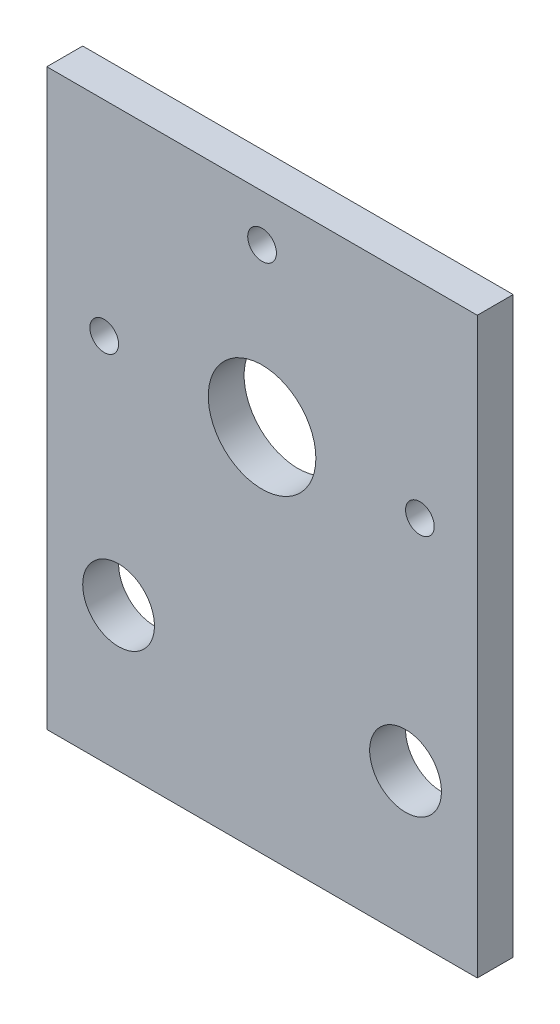
ISO-10303-21;
HEADER;
FILE_DESCRIPTION(('STEP AP214'),'2;1');
FILE_NAME('part.step','',(''),(''),'','','');
FILE_SCHEMA(('AUTOMOTIVE_DESIGN { 1 0 10303 214 1 1 1 1 }'));
ENDSEC;
DATA;
#1=APPLICATION_CONTEXT('core data for automotive mechanical design processes');
#2=APPLICATION_PROTOCOL_DEFINITION('international standard','automotive_design',2000,#1);
#3=PRODUCT_CONTEXT('',#1,'mechanical');
#4=PRODUCT('Part','Part','',(#3));
#5=PRODUCT_RELATED_PRODUCT_CATEGORY('part','',(#4));
#6=PRODUCT_DEFINITION_FORMATION('','',#4);
#7=PRODUCT_DEFINITION_CONTEXT('part definition',#1,'design');
#8=PRODUCT_DEFINITION('design','',#6,#7);
#9=PRODUCT_DEFINITION_SHAPE('','',#8);
#10=(LENGTH_UNIT() NAMED_UNIT(*) SI_UNIT(.MILLI.,.METRE.));
#11=(NAMED_UNIT(*) PLANE_ANGLE_UNIT() SI_UNIT($,.RADIAN.));
#12=(NAMED_UNIT(*) SI_UNIT($,.STERADIAN.) SOLID_ANGLE_UNIT());
#13=UNCERTAINTY_MEASURE_WITH_UNIT(LENGTH_MEASURE(1.E-05),#10,'distance_accuracy_value','');
#14=(GEOMETRIC_REPRESENTATION_CONTEXT(3) GLOBAL_UNCERTAINTY_ASSIGNED_CONTEXT((#13)) GLOBAL_UNIT_ASSIGNED_CONTEXT((#10,
#11,#12)) REPRESENTATION_CONTEXT('',''));
#15=CARTESIAN_POINT('',(0.,0.,0.));
#16=DIRECTION('',(0.,0.,1.));
#17=DIRECTION('',(1.,0.,0.));
#18=AXIS2_PLACEMENT_3D('',#15,#16,#17);
#19=CARTESIAN_POINT('',(0.,0.,5.));
#20=DIRECTION('',(0.,0.,1.));
#21=DIRECTION('',(1.,0.,0.));
#22=AXIS2_PLACEMENT_3D('',#19,#20,#21);
#23=PLANE('',#22);
#24=CARTESIAN_POINT('',(0.,33.5,5.));
#25=DIRECTION('',(0.,0.,1.));
#26=DIRECTION('',(1.,0.,0.));
#27=AXIS2_PLACEMENT_3D('',#24,#25,#26);
#28=CIRCLE('',#27,2.);
#29=CARTESIAN_POINT('',(2.,33.5,5.));
#30=VERTEX_POINT('',#29);
#31=EDGE_CURVE('E135',#30,#30,#28,.T.);
#32=ORIENTED_EDGE('',*,*,#31,.F.);
#33=EDGE_LOOP('',(#32));
#34=FACE_BOUND('',#33,.T.);
#35=CARTESIAN_POINT('',(-20.,-20.,5.));
#36=DIRECTION('',(0.,0.,1.));
#37=DIRECTION('',(-1.,0.,0.));
#38=AXIS2_PLACEMENT_3D('',#35,#36,#37);
#39=CIRCLE('',#38,5.);
#40=CARTESIAN_POINT('',(-25.,-20.,5.));
#41=VERTEX_POINT('',#40);
#42=EDGE_CURVE('E123',#41,#41,#39,.T.);
#43=ORIENTED_EDGE('',*,*,#42,.F.);
#44=EDGE_LOOP('',(#43));
#45=FACE_BOUND('',#44,.T.);
#46=CARTESIAN_POINT('',(0.,11.5,5.));
#47=DIRECTION('',(0.,0.,1.));
#48=DIRECTION('',(1.,0.,0.));
#49=AXIS2_PLACEMENT_3D('',#46,#47,#48);
#50=CIRCLE('',#49,7.5);
#51=CARTESIAN_POINT('',(7.5,11.5,5.));
#52=VERTEX_POINT('',#51);
#53=EDGE_CURVE('E102',#52,#52,#50,.T.);
#54=ORIENTED_EDGE('',*,*,#53,.F.);
#55=EDGE_LOOP('',(#54));
#56=FACE_BOUND('',#55,.T.);
#57=DIRECTION('',(0.,1.,0.));
#58=VECTOR('',#57,1.);
#59=CARTESIAN_POINT('',(30.,40.,5.));
#60=LINE('',#59,#58);
#61=CARTESIAN_POINT('',(30.,-40.,5.));
#62=VERTEX_POINT('',#61);
#63=CARTESIAN_POINT('',(30.,40.,5.));
#64=VERTEX_POINT('',#63);
#65=EDGE_CURVE('E87',#62,#64,#60,.T.);
#66=ORIENTED_EDGE('',*,*,#65,.T.);
#67=DIRECTION('',(-1.,0.,0.));
#68=VECTOR('',#67,1.);
#69=CARTESIAN_POINT('',(-30.,40.,5.));
#70=LINE('',#69,#68);
#71=CARTESIAN_POINT('',(-30.,40.,5.));
#72=VERTEX_POINT('',#71);
#73=EDGE_CURVE('E82',#64,#72,#70,.T.);
#74=ORIENTED_EDGE('',*,*,#73,.T.);
#75=DIRECTION('',(0.,-1.,0.));
#76=VECTOR('',#75,1.);
#77=CARTESIAN_POINT('',(-30.,40.,5.));
#78=LINE('',#77,#76);
#79=CARTESIAN_POINT('',(-30.,-40.,5.));
#80=VERTEX_POINT('',#79);
#81=EDGE_CURVE('E85',#72,#80,#78,.T.);
#82=ORIENTED_EDGE('',*,*,#81,.T.);
#83=DIRECTION('',(1.,0.,0.));
#84=VECTOR('',#83,1.);
#85=CARTESIAN_POINT('',(-30.,-40.,5.));
#86=LINE('',#85,#84);
#87=EDGE_CURVE('E52',#80,#62,#86,.T.);
#88=ORIENTED_EDGE('',*,*,#87,.T.);
#89=EDGE_LOOP('',(#66,#74,#82,#88));
#90=FACE_BOUND('',#89,.T.);
#91=CARTESIAN_POINT('',(20.,-20.,5.));
#92=DIRECTION('',(0.,0.,1.));
#93=DIRECTION('',(1.,0.,0.));
#94=AXIS2_PLACEMENT_3D('',#91,#92,#93);
#95=CIRCLE('',#94,5.);
#96=CARTESIAN_POINT('',(25.,-20.,5.));
#97=VERTEX_POINT('',#96);
#98=EDGE_CURVE('E117',#97,#97,#95,.T.);
#99=ORIENTED_EDGE('',*,*,#98,.F.);
#100=EDGE_LOOP('',(#99));
#101=FACE_BOUND('',#100,.T.);
#102=CARTESIAN_POINT('',(22.,11.5,5.));
#103=DIRECTION('',(0.,0.,1.));
#104=DIRECTION('',(-1.,0.,0.));
#105=AXIS2_PLACEMENT_3D('',#102,#103,#104);
#106=CIRCLE('',#105,2.);
#107=CARTESIAN_POINT('',(20.,11.5,5.));
#108=VERTEX_POINT('',#107);
#109=EDGE_CURVE('E129',#108,#108,#106,.T.);
#110=ORIENTED_EDGE('',*,*,#109,.F.);
#111=EDGE_LOOP('',(#110));
#112=FACE_BOUND('',#111,.T.);
#113=CARTESIAN_POINT('',(-22.,11.5,5.));
#114=DIRECTION('',(0.,0.,1.));
#115=DIRECTION('',(1.,0.,0.));
#116=AXIS2_PLACEMENT_3D('',#113,#114,#115);
#117=CIRCLE('',#116,2.);
#118=CARTESIAN_POINT('',(-20.,11.5,5.));
#119=VERTEX_POINT('',#118);
#120=EDGE_CURVE('E141',#119,#119,#117,.T.);
#121=ORIENTED_EDGE('',*,*,#120,.F.);
#122=EDGE_LOOP('',(#121));
#123=FACE_BOUND('',#122,.T.);
#124=ADVANCED_FACE('F35',(#34,#45,#56,#90,#101,#112,#123),#23,.T.);
#125=CARTESIAN_POINT('',(0.,0.,0.));
#126=DIRECTION('',(0.,0.,1.));
#127=DIRECTION('',(1.,0.,0.));
#128=AXIS2_PLACEMENT_3D('',#125,#126,#127);
#129=PLANE('',#128);
#130=DIRECTION('',(0.,1.,0.));
#131=VECTOR('',#130,1.);
#132=CARTESIAN_POINT('',(30.,40.,0.));
#133=LINE('',#132,#131);
#134=CARTESIAN_POINT('',(30.,-40.,0.));
#135=VERTEX_POINT('',#134);
#136=CARTESIAN_POINT('',(30.,40.,0.));
#137=VERTEX_POINT('',#136);
#138=EDGE_CURVE('E99',#135,#137,#133,.T.);
#139=ORIENTED_EDGE('',*,*,#138,.F.);
#140=DIRECTION('',(1.,0.,0.));
#141=VECTOR('',#140,1.);
#142=CARTESIAN_POINT('',(-30.,-40.,0.));
#143=LINE('',#142,#141);
#144=CARTESIAN_POINT('',(-30.,-40.,0.));
#145=VERTEX_POINT('',#144);
#146=EDGE_CURVE('E75',#145,#135,#143,.T.);
#147=ORIENTED_EDGE('',*,*,#146,.F.);
#148=DIRECTION('',(0.,-1.,0.));
#149=VECTOR('',#148,1.);
#150=CARTESIAN_POINT('',(-30.,40.,0.));
#151=LINE('',#150,#149);
#152=CARTESIAN_POINT('',(-30.,40.,0.));
#153=VERTEX_POINT('',#152);
#154=EDGE_CURVE('E69',#153,#145,#151,.T.);
#155=ORIENTED_EDGE('',*,*,#154,.F.);
#156=DIRECTION('',(-1.,0.,0.));
#157=VECTOR('',#156,1.);
#158=CARTESIAN_POINT('',(-30.,40.,0.));
#159=LINE('',#158,#157);
#160=EDGE_CURVE('E91',#137,#153,#159,.T.);
#161=ORIENTED_EDGE('',*,*,#160,.F.);
#162=EDGE_LOOP('',(#139,#147,#155,#161));
#163=FACE_BOUND('',#162,.T.);
#164=CARTESIAN_POINT('',(0.,11.5,0.));
#165=DIRECTION('',(0.,0.,1.));
#166=DIRECTION('',(1.,0.,0.));
#167=AXIS2_PLACEMENT_3D('',#164,#165,#166);
#168=CIRCLE('',#167,7.5);
#169=CARTESIAN_POINT('',(7.5,11.5,0.));
#170=VERTEX_POINT('',#169);
#171=EDGE_CURVE('E114',#170,#170,#168,.T.);
#172=ORIENTED_EDGE('',*,*,#171,.T.);
#173=EDGE_LOOP('',(#172));
#174=FACE_BOUND('',#173,.T.);
#175=CARTESIAN_POINT('',(20.,-20.,0.));
#176=DIRECTION('',(0.,0.,1.));
#177=DIRECTION('',(1.,0.,0.));
#178=AXIS2_PLACEMENT_3D('',#175,#176,#177);
#179=CIRCLE('',#178,5.);
#180=CARTESIAN_POINT('',(25.,-20.,0.));
#181=VERTEX_POINT('',#180);
#182=EDGE_CURVE('E120',#181,#181,#179,.T.);
#183=ORIENTED_EDGE('',*,*,#182,.T.);
#184=EDGE_LOOP('',(#183));
#185=FACE_BOUND('',#184,.T.);
#186=CARTESIAN_POINT('',(-20.,-20.,0.));
#187=DIRECTION('',(0.,0.,1.));
#188=DIRECTION('',(-1.,0.,0.));
#189=AXIS2_PLACEMENT_3D('',#186,#187,#188);
#190=CIRCLE('',#189,5.);
#191=CARTESIAN_POINT('',(-25.,-20.,0.));
#192=VERTEX_POINT('',#191);
#193=EDGE_CURVE('E126',#192,#192,#190,.T.);
#194=ORIENTED_EDGE('',*,*,#193,.T.);
#195=EDGE_LOOP('',(#194));
#196=FACE_BOUND('',#195,.T.);
#197=CARTESIAN_POINT('',(22.,11.5,0.));
#198=DIRECTION('',(0.,0.,1.));
#199=DIRECTION('',(-1.,0.,0.));
#200=AXIS2_PLACEMENT_3D('',#197,#198,#199);
#201=CIRCLE('',#200,2.);
#202=CARTESIAN_POINT('',(20.,11.5,0.));
#203=VERTEX_POINT('',#202);
#204=EDGE_CURVE('E132',#203,#203,#201,.T.);
#205=ORIENTED_EDGE('',*,*,#204,.T.);
#206=EDGE_LOOP('',(#205));
#207=FACE_BOUND('',#206,.T.);
#208=CARTESIAN_POINT('',(0.,33.5,0.));
#209=DIRECTION('',(0.,0.,1.));
#210=DIRECTION('',(1.,0.,0.));
#211=AXIS2_PLACEMENT_3D('',#208,#209,#210);
#212=CIRCLE('',#211,2.);
#213=CARTESIAN_POINT('',(2.,33.5,0.));
#214=VERTEX_POINT('',#213);
#215=EDGE_CURVE('E138',#214,#214,#212,.T.);
#216=ORIENTED_EDGE('',*,*,#215,.T.);
#217=EDGE_LOOP('',(#216));
#218=FACE_BOUND('',#217,.T.);
#219=CARTESIAN_POINT('',(-22.,11.5,0.));
#220=DIRECTION('',(0.,0.,1.));
#221=DIRECTION('',(1.,0.,0.));
#222=AXIS2_PLACEMENT_3D('',#219,#220,#221);
#223=CIRCLE('',#222,2.);
#224=CARTESIAN_POINT('',(-20.,11.5,0.));
#225=VERTEX_POINT('',#224);
#226=EDGE_CURVE('E144',#225,#225,#223,.T.);
#227=ORIENTED_EDGE('',*,*,#226,.T.);
#228=EDGE_LOOP('',(#227));
#229=FACE_BOUND('',#228,.T.);
#230=ADVANCED_FACE('F110',(#163,#174,#185,#196,#207,#218,#229),#129,.F.);
#231=CARTESIAN_POINT('',(30.,40.,5.));
#232=DIRECTION('',(-1.,0.,0.));
#233=DIRECTION('',(0.,-1.,0.));
#234=AXIS2_PLACEMENT_3D('',#231,#232,#233);
#235=PLANE('',#234);
#236=ORIENTED_EDGE('',*,*,#138,.T.);
#237=DIRECTION('',(0.,0.,-1.));
#238=VECTOR('',#237,1.);
#239=CARTESIAN_POINT('',(30.,40.,5.));
#240=LINE('',#239,#238);
#241=EDGE_CURVE('E11',#64,#137,#240,.T.);
#242=ORIENTED_EDGE('',*,*,#241,.F.);
#243=ORIENTED_EDGE('',*,*,#65,.F.);
#244=DIRECTION('',(0.,0.,-1.));
#245=VECTOR('',#244,1.);
#246=CARTESIAN_POINT('',(30.,-40.,5.));
#247=LINE('',#246,#245);
#248=EDGE_CURVE('E95',#62,#135,#247,.T.);
#249=ORIENTED_EDGE('',*,*,#248,.T.);
#250=EDGE_LOOP('',(#236,#242,#243,#249));
#251=FACE_BOUND('',#250,.T.);
#252=ADVANCED_FACE('F37',(#251),#235,.F.);
#253=CARTESIAN_POINT('',(-30.,40.,5.));
#254=DIRECTION('',(0.,-1.,0.));
#255=DIRECTION('',(0.,0.,-1.));
#256=AXIS2_PLACEMENT_3D('',#253,#254,#255);
#257=PLANE('',#256);
#258=ORIENTED_EDGE('',*,*,#160,.T.);
#259=DIRECTION('',(0.,0.,-1.));
#260=VECTOR('',#259,1.);
#261=CARTESIAN_POINT('',(-30.,40.,5.));
#262=LINE('',#261,#260);
#263=EDGE_CURVE('E44',#72,#153,#262,.T.);
#264=ORIENTED_EDGE('',*,*,#263,.F.);
#265=ORIENTED_EDGE('',*,*,#73,.F.);
#266=ORIENTED_EDGE('',*,*,#241,.T.);
#267=EDGE_LOOP('',(#258,#264,#265,#266));
#268=FACE_BOUND('',#267,.T.);
#269=ADVANCED_FACE('F90',(#268),#257,.F.);
#270=CARTESIAN_POINT('',(-30.,40.,5.));
#271=DIRECTION('',(1.,0.,0.));
#272=DIRECTION('',(0.,1.,0.));
#273=AXIS2_PLACEMENT_3D('',#270,#271,#272);
#274=PLANE('',#273);
#275=ORIENTED_EDGE('',*,*,#154,.T.);
#276=DIRECTION('',(0.,0.,-1.));
#277=VECTOR('',#276,1.);
#278=CARTESIAN_POINT('',(-30.,-40.,5.));
#279=LINE('',#278,#277);
#280=EDGE_CURVE('E92',#80,#145,#279,.T.);
#281=ORIENTED_EDGE('',*,*,#280,.F.);
#282=ORIENTED_EDGE('',*,*,#81,.F.);
#283=ORIENTED_EDGE('',*,*,#263,.T.);
#284=EDGE_LOOP('',(#275,#281,#282,#283));
#285=FACE_BOUND('',#284,.T.);
#286=ADVANCED_FACE('F93',(#285),#274,.F.);
#287=CARTESIAN_POINT('',(-30.,-40.,5.));
#288=DIRECTION('',(0.,1.,0.));
#289=DIRECTION('',(0.,0.,1.));
#290=AXIS2_PLACEMENT_3D('',#287,#288,#289);
#291=PLANE('',#290);
#292=ORIENTED_EDGE('',*,*,#146,.T.);
#293=ORIENTED_EDGE('',*,*,#248,.F.);
#294=ORIENTED_EDGE('',*,*,#87,.F.);
#295=ORIENTED_EDGE('',*,*,#280,.T.);
#296=EDGE_LOOP('',(#292,#293,#294,#295));
#297=FACE_BOUND('',#296,.T.);
#298=ADVANCED_FACE('F107',(#297),#291,.F.);
#299=CARTESIAN_POINT('',(0.,11.5,5.));
#300=DIRECTION('',(0.,0.,-1.));
#301=DIRECTION('',(-1.,0.,0.));
#302=AXIS2_PLACEMENT_3D('',#299,#300,#301);
#303=CYLINDRICAL_SURFACE('',#302,7.5);
#304=ORIENTED_EDGE('',*,*,#53,.T.);
#305=EDGE_LOOP('',(#304));
#306=FACE_BOUND('',#305,.T.);
#307=ORIENTED_EDGE('',*,*,#171,.F.);
#308=EDGE_LOOP('',(#307));
#309=FACE_BOUND('',#308,.T.);
#310=ADVANCED_FACE('F163',(#306,#309),#303,.F.);
#311=CARTESIAN_POINT('',(20.,-20.,5.));
#312=DIRECTION('',(0.,0.,-1.));
#313=DIRECTION('',(-1.,0.,0.));
#314=AXIS2_PLACEMENT_3D('',#311,#312,#313);
#315=CYLINDRICAL_SURFACE('',#314,5.);
#316=ORIENTED_EDGE('',*,*,#98,.T.);
#317=EDGE_LOOP('',(#316));
#318=FACE_BOUND('',#317,.T.);
#319=ORIENTED_EDGE('',*,*,#182,.F.);
#320=EDGE_LOOP('',(#319));
#321=FACE_BOUND('',#320,.T.);
#322=ADVANCED_FACE('F209',(#318,#321),#315,.F.);
#323=CARTESIAN_POINT('',(-20.,-20.,5.));
#324=DIRECTION('',(0.,0.,-1.));
#325=DIRECTION('',(-1.,0.,0.));
#326=AXIS2_PLACEMENT_3D('',#323,#324,#325);
#327=CYLINDRICAL_SURFACE('',#326,5.);
#328=ORIENTED_EDGE('',*,*,#42,.T.);
#329=EDGE_LOOP('',(#328));
#330=FACE_BOUND('',#329,.T.);
#331=ORIENTED_EDGE('',*,*,#193,.F.);
#332=EDGE_LOOP('',(#331));
#333=FACE_BOUND('',#332,.T.);
#334=ADVANCED_FACE('F217',(#330,#333),#327,.F.);
#335=CARTESIAN_POINT('',(22.,11.5,5.));
#336=DIRECTION('',(0.,0.,-1.));
#337=DIRECTION('',(-1.,0.,0.));
#338=AXIS2_PLACEMENT_3D('',#335,#336,#337);
#339=CYLINDRICAL_SURFACE('',#338,2.);
#340=ORIENTED_EDGE('',*,*,#109,.T.);
#341=EDGE_LOOP('',(#340));
#342=FACE_BOUND('',#341,.T.);
#343=ORIENTED_EDGE('',*,*,#204,.F.);
#344=EDGE_LOOP('',(#343));
#345=FACE_BOUND('',#344,.T.);
#346=ADVANCED_FACE('F225',(#342,#345),#339,.F.);
#347=CARTESIAN_POINT('',(0.,33.5,5.));
#348=DIRECTION('',(0.,0.,-1.));
#349=DIRECTION('',(-1.,0.,0.));
#350=AXIS2_PLACEMENT_3D('',#347,#348,#349);
#351=CYLINDRICAL_SURFACE('',#350,2.);
#352=ORIENTED_EDGE('',*,*,#31,.T.);
#353=EDGE_LOOP('',(#352));
#354=FACE_BOUND('',#353,.T.);
#355=ORIENTED_EDGE('',*,*,#215,.F.);
#356=EDGE_LOOP('',(#355));
#357=FACE_BOUND('',#356,.T.);
#358=ADVANCED_FACE('F234',(#354,#357),#351,.F.);
#359=CARTESIAN_POINT('',(-22.,11.5,5.));
#360=DIRECTION('',(0.,0.,-1.));
#361=DIRECTION('',(-1.,0.,0.));
#362=AXIS2_PLACEMENT_3D('',#359,#360,#361);
#363=CYLINDRICAL_SURFACE('',#362,2.);
#364=ORIENTED_EDGE('',*,*,#120,.T.);
#365=EDGE_LOOP('',(#364));
#366=FACE_BOUND('',#365,.T.);
#367=ORIENTED_EDGE('',*,*,#226,.F.);
#368=EDGE_LOOP('',(#367));
#369=FACE_BOUND('',#368,.T.);
#370=ADVANCED_FACE('F150',(#366,#369),#363,.F.);
#371=CLOSED_SHELL('',(#124,#230,#252,#269,#286,#298,#310,#322,#334,#346,#358,#370));
#372=MANIFOLD_SOLID_BREP('B2',#371);
#373=ADVANCED_BREP_SHAPE_REPRESENTATION('',(#18,#372),#14);
#374=SHAPE_DEFINITION_REPRESENTATION(#9,#373);
ENDSEC;
END-ISO-10303-21;
